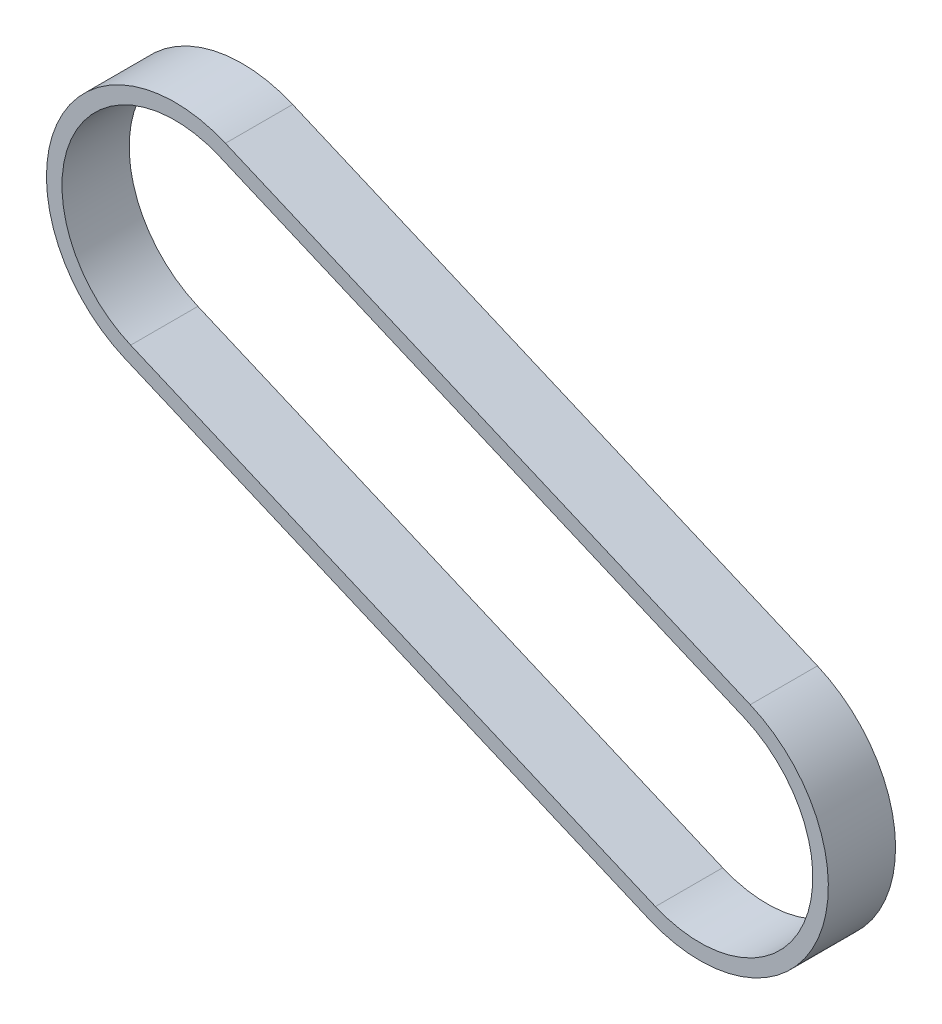
ISO-10303-21;
HEADER;
FILE_DESCRIPTION(('STEP AP214'),'2;1');
FILE_NAME('part.step','',(''),(''),'','','');
FILE_SCHEMA(('AUTOMOTIVE_DESIGN { 1 0 10303 214 1 1 1 1 }'));
ENDSEC;
DATA;
#1=APPLICATION_CONTEXT('core data for automotive mechanical design processes');
#2=APPLICATION_PROTOCOL_DEFINITION('international standard','automotive_design',2000,#1);
#3=PRODUCT_CONTEXT('',#1,'mechanical');
#4=PRODUCT('Part','Part','',(#3));
#5=PRODUCT_RELATED_PRODUCT_CATEGORY('part','',(#4));
#6=PRODUCT_DEFINITION_FORMATION('','',#4);
#7=PRODUCT_DEFINITION_CONTEXT('part definition',#1,'design');
#8=PRODUCT_DEFINITION('design','',#6,#7);
#9=PRODUCT_DEFINITION_SHAPE('','',#8);
#10=(LENGTH_UNIT() NAMED_UNIT(*) SI_UNIT(.MILLI.,.METRE.));
#11=(NAMED_UNIT(*) PLANE_ANGLE_UNIT() SI_UNIT($,.RADIAN.));
#12=(NAMED_UNIT(*) SI_UNIT($,.STERADIAN.) SOLID_ANGLE_UNIT());
#13=UNCERTAINTY_MEASURE_WITH_UNIT(LENGTH_MEASURE(1.E-05),#10,'distance_accuracy_value','');
#14=(GEOMETRIC_REPRESENTATION_CONTEXT(3) GLOBAL_UNCERTAINTY_ASSIGNED_CONTEXT((#13)) GLOBAL_UNIT_ASSIGNED_CONTEXT((#10,
#11,#12)) REPRESENTATION_CONTEXT('',''));
#15=CARTESIAN_POINT('',(0.,0.,0.));
#16=DIRECTION('',(0.,0.,1.));
#17=DIRECTION('',(1.,0.,0.));
#18=AXIS2_PLACEMENT_3D('',#15,#16,#17);
#19=CARTESIAN_POINT('',(-0.322109758430805,0.89426872354878,-161.236191106852));
#20=DIRECTION('',(0.,0.,1.));
#21=DIRECTION('',(1.,0.,0.));
#22=AXIS2_PLACEMENT_3D('',#19,#20,#21);
#23=CYLINDRICAL_SURFACE('',#22,21.04);
#24=DIRECTION('',(0.,0.,1.));
#25=VECTOR('',#24,1.);
#26=CARTESIAN_POINT('',(-8.57598271858708,-18.4591594264613,-161.236191106852));
#27=LINE('',#26,#25);
#28=CARTESIAN_POINT('',(-8.57598271858708,-18.4591594264613,-11.0000000000194));
#29=VERTEX_POINT('',#28);
#30=CARTESIAN_POINT('',(-8.57598271858708,-18.4591594264613,0.));
#31=VERTEX_POINT('',#30);
#32=EDGE_CURVE('E153',#29,#31,#27,.T.);
#33=ORIENTED_EDGE('',*,*,#32,.F.);
#34=CARTESIAN_POINT('',(-0.322109758430805,0.89426872354878,-11.0000000000195));
#35=DIRECTION('',(0.,0.,-1.));
#36=DIRECTION('',(0.,1.,0.));
#37=AXIS2_PLACEMENT_3D('',#34,#35,#36);
#38=CIRCLE('',#37,21.04);
#39=CARTESIAN_POINT('',(7.93176320172548,20.2476968735588,-11.0000000000195));
#40=VERTEX_POINT('',#39);
#41=EDGE_CURVE('E147',#29,#40,#38,.F.);
#42=ORIENTED_EDGE('',*,*,#41,.T.);
#43=DIRECTION('',(0.,0.,1.));
#44=VECTOR('',#43,1.);
#45=CARTESIAN_POINT('',(7.93176320172548,20.2476968735588,-161.236191106852));
#46=LINE('',#45,#44);
#47=CARTESIAN_POINT('',(7.93176320172548,20.2476968735588,0.));
#48=VERTEX_POINT('',#47);
#49=EDGE_CURVE('E149',#40,#48,#46,.T.);
#50=ORIENTED_EDGE('',*,*,#49,.T.);
#51=CARTESIAN_POINT('',(-0.322109758430805,0.89426872354878,0.));
#52=DIRECTION('',(0.,0.,-1.));
#53=DIRECTION('',(-1.,0.,0.));
#54=AXIS2_PLACEMENT_3D('',#51,#52,#53);
#55=CIRCLE('',#54,21.04);
#56=EDGE_CURVE('E175',#31,#48,#55,.F.);
#57=ORIENTED_EDGE('',*,*,#56,.F.);
#58=EDGE_LOOP('',(#33,#42,#50,#57));
#59=FACE_BOUND('',#58,.T.);
#60=ADVANCED_FACE('F59',(#59),#23,.T.);
#61=CARTESIAN_POINT('',(-8.57598271858708,-18.4591594264613,-161.236191106852));
#62=DIRECTION('',(-0.39229434221275,-0.919839740970059,0.));
#63=DIRECTION('',(0.919839740970059,-0.39229434221275,0.));
#64=AXIS2_PLACEMENT_3D('',#61,#62,#63);
#65=PLANE('',#64);
#66=DIRECTION('',(0.,0.,1.));
#67=VECTOR('',#66,1.);
#68=CARTESIAN_POINT('',(-94.4636745780762,18.1703251255509,-161.236191106852));
#69=LINE('',#68,#67);
#70=CARTESIAN_POINT('',(-94.4636745780762,18.1703251255509,-11.0000000000195));
#71=VERTEX_POINT('',#70);
#72=CARTESIAN_POINT('',(-94.4636745780762,18.1703251255509,0.));
#73=VERTEX_POINT('',#72);
#74=EDGE_CURVE('E156',#71,#73,#69,.T.);
#75=ORIENTED_EDGE('',*,*,#74,.F.);
#76=DIRECTION('',(0.919839740970059,-0.39229434221275,0.));
#77=VECTOR('',#76,1.);
#78=CARTESIAN_POINT('',(-8.57598271858715,-18.4591594264612,-11.0000000000194));
#79=LINE('',#78,#77);
#80=EDGE_CURVE('E150',#71,#29,#79,.T.);
#81=ORIENTED_EDGE('',*,*,#80,.T.);
#82=ORIENTED_EDGE('',*,*,#32,.T.);
#83=DIRECTION('',(0.919839740970059,-0.392294342212751,0.));
#84=VECTOR('',#83,1.);
#85=CARTESIAN_POINT('',(-8.57598271858708,-18.4591594264613,0.));
#86=LINE('',#85,#84);
#87=EDGE_CURVE('E142',#73,#31,#86,.T.);
#88=ORIENTED_EDGE('',*,*,#87,.F.);
#89=EDGE_LOOP('',(#75,#81,#82,#88));
#90=FACE_BOUND('',#89,.T.);
#91=ADVANCED_FACE('F195',(#90),#65,.T.);
#92=CARTESIAN_POINT('',(-86.2098016179199,37.523753275561,-161.236191106852));
#93=DIRECTION('',(0.,0.,1.));
#94=DIRECTION('',(1.,0.,0.));
#95=AXIS2_PLACEMENT_3D('',#92,#93,#94);
#96=CYLINDRICAL_SURFACE('',#95,21.04);
#97=DIRECTION('',(0.,0.,1.));
#98=VECTOR('',#97,1.);
#99=CARTESIAN_POINT('',(-77.9559286577636,56.877181425571,-161.236191106852));
#100=LINE('',#99,#98);
#101=CARTESIAN_POINT('',(-77.9559286577636,56.877181425571,-11.0000000000195));
#102=VERTEX_POINT('',#101);
#103=CARTESIAN_POINT('',(-77.9559286577636,56.877181425571,0.));
#104=VERTEX_POINT('',#103);
#105=EDGE_CURVE('E160',#102,#104,#100,.T.);
#106=ORIENTED_EDGE('',*,*,#105,.F.);
#107=CARTESIAN_POINT('',(-86.2098016179199,37.523753275561,-11.0000000000195));
#108=DIRECTION('',(0.,0.,-1.));
#109=DIRECTION('',(0.,1.,0.));
#110=AXIS2_PLACEMENT_3D('',#107,#108,#109);
#111=CIRCLE('',#110,21.04);
#112=EDGE_CURVE('E154',#102,#71,#111,.F.);
#113=ORIENTED_EDGE('',*,*,#112,.T.);
#114=ORIENTED_EDGE('',*,*,#74,.T.);
#115=CARTESIAN_POINT('',(-86.2098016179199,37.523753275561,0.));
#116=DIRECTION('',(0.,0.,-1.));
#117=DIRECTION('',(-1.,0.,0.));
#118=AXIS2_PLACEMENT_3D('',#115,#116,#117);
#119=CIRCLE('',#118,21.04);
#120=EDGE_CURVE('E185',#104,#73,#119,.F.);
#121=ORIENTED_EDGE('',*,*,#120,.F.);
#122=EDGE_LOOP('',(#106,#113,#114,#121));
#123=FACE_BOUND('',#122,.T.);
#124=ADVANCED_FACE('F203',(#123),#96,.T.);
#125=CARTESIAN_POINT('',(7.93176320172546,20.2476968735588,-161.236191106852));
#126=DIRECTION('',(0.39229434221275,0.919839740970059,0.));
#127=DIRECTION('',(-0.919839740970059,0.39229434221275,0.));
#128=AXIS2_PLACEMENT_3D('',#125,#126,#127);
#129=PLANE('',#128);
#130=ORIENTED_EDGE('',*,*,#49,.F.);
#131=DIRECTION('',(-0.919839740970059,0.39229434221275,0.));
#132=VECTOR('',#131,1.);
#133=CARTESIAN_POINT('',(7.93176320172539,20.2476968735588,-11.0000000000195));
#134=LINE('',#133,#132);
#135=EDGE_CURVE('E77',#40,#102,#134,.T.);
#136=ORIENTED_EDGE('',*,*,#135,.T.);
#137=ORIENTED_EDGE('',*,*,#105,.T.);
#138=DIRECTION('',(-0.919839740970059,0.392294342212751,0.));
#139=VECTOR('',#138,1.);
#140=CARTESIAN_POINT('',(7.93176320172546,20.2476968735588,0.));
#141=LINE('',#140,#139);
#142=EDGE_CURVE('E180',#48,#104,#141,.T.);
#143=ORIENTED_EDGE('',*,*,#142,.F.);
#144=EDGE_LOOP('',(#130,#136,#137,#143));
#145=FACE_BOUND('',#144,.T.);
#146=ADVANCED_FACE('F200',(#145),#129,.T.);
#147=CARTESIAN_POINT('',(-0.322109758430805,0.89426872354878,-161.236191106852));
#148=DIRECTION('',(0.,0.,1.));
#149=DIRECTION('',(1.,0.,0.));
#150=AXIS2_PLACEMENT_3D('',#147,#148,#149);
#151=CYLINDRICAL_SURFACE('',#150,18.5);
#152=CARTESIAN_POINT('',(-0.322109758430805,0.89426872354878,-11.0000000000195));
#153=DIRECTION('',(0.,0.,-1.));
#154=DIRECTION('',(0.,1.,0.));
#155=AXIS2_PLACEMENT_3D('',#152,#153,#154);
#156=CIRCLE('',#155,18.5);
#157=CARTESIAN_POINT('',(-7.57955508936669,-16.1227664843973,-11.0000000000195));
#158=VERTEX_POINT('',#157);
#159=CARTESIAN_POINT('',(6.93533557250508,17.9113039314949,-11.0000000000195));
#160=VERTEX_POINT('',#159);
#161=EDGE_CURVE('E123',#158,#160,#156,.F.);
#162=ORIENTED_EDGE('',*,*,#161,.F.);
#163=DIRECTION('',(0.,0.,1.));
#164=VECTOR('',#163,1.);
#165=CARTESIAN_POINT('',(-7.57955508936669,-16.1227664843973,-161.236191106852));
#166=LINE('',#165,#164);
#167=CARTESIAN_POINT('',(-7.57955508936669,-16.1227664843973,0.));
#168=VERTEX_POINT('',#167);
#169=EDGE_CURVE('E162',#158,#168,#166,.T.);
#170=ORIENTED_EDGE('',*,*,#169,.T.);
#171=CARTESIAN_POINT('',(-0.322109758430805,0.89426872354878,0.));
#172=DIRECTION('',(0.,0.,1.));
#173=DIRECTION('',(-1.,0.,0.));
#174=AXIS2_PLACEMENT_3D('',#171,#172,#173);
#175=CIRCLE('',#174,18.5);
#176=CARTESIAN_POINT('',(6.93533557250508,17.9113039314949,0.));
#177=VERTEX_POINT('',#176);
#178=EDGE_CURVE('E126',#168,#177,#175,.T.);
#179=ORIENTED_EDGE('',*,*,#178,.T.);
#180=DIRECTION('',(0.,0.,1.));
#181=VECTOR('',#180,1.);
#182=CARTESIAN_POINT('',(6.93533557250508,17.9113039314949,-161.236191106852));
#183=LINE('',#182,#181);
#184=EDGE_CURVE('E63',#160,#177,#183,.T.);
#185=ORIENTED_EDGE('',*,*,#184,.F.);
#186=EDGE_LOOP('',(#162,#170,#179,#185));
#187=FACE_BOUND('',#186,.T.);
#188=ADVANCED_FACE('F121',(#187),#151,.F.);
#189=CARTESIAN_POINT('',(-7.57955508936669,-16.1227664843973,-161.236191106852));
#190=DIRECTION('',(-0.39229434221275,-0.919839740970059,0.));
#191=DIRECTION('',(0.919839740970059,-0.392294342212751,0.));
#192=AXIS2_PLACEMENT_3D('',#189,#190,#191);
#193=PLANE('',#192);
#194=DIRECTION('',(0.919839740970059,-0.39229434221275,0.));
#195=VECTOR('',#194,1.);
#196=CARTESIAN_POINT('',(-7.57955508936676,-16.1227664843973,-11.0000000000194));
#197=LINE('',#196,#195);
#198=CARTESIAN_POINT('',(-93.4672469488558,20.5067180676149,-11.0000000000196));
#199=VERTEX_POINT('',#198);
#200=EDGE_CURVE('E140',#199,#158,#197,.T.);
#201=ORIENTED_EDGE('',*,*,#200,.F.);
#202=DIRECTION('',(0.,0.,1.));
#203=VECTOR('',#202,1.);
#204=CARTESIAN_POINT('',(-93.4672469488558,20.5067180676149,-161.236191106852));
#205=LINE('',#204,#203);
#206=CARTESIAN_POINT('',(-93.4672469488558,20.5067180676149,0.));
#207=VERTEX_POINT('',#206);
#208=EDGE_CURVE('E165',#199,#207,#205,.T.);
#209=ORIENTED_EDGE('',*,*,#208,.T.);
#210=DIRECTION('',(0.919839740970059,-0.39229434221275,0.));
#211=VECTOR('',#210,1.);
#212=CARTESIAN_POINT('',(-7.57955508936669,-16.1227664843973,0.));
#213=LINE('',#212,#211);
#214=EDGE_CURVE('E166',#207,#168,#213,.T.);
#215=ORIENTED_EDGE('',*,*,#214,.T.);
#216=ORIENTED_EDGE('',*,*,#169,.F.);
#217=EDGE_LOOP('',(#201,#209,#215,#216));
#218=FACE_BOUND('',#217,.T.);
#219=ADVANCED_FACE('F223',(#218),#193,.F.);
#220=CARTESIAN_POINT('',(-86.2098016179199,37.523753275561,-161.236191106852));
#221=DIRECTION('',(0.,0.,1.));
#222=DIRECTION('',(1.,0.,0.));
#223=AXIS2_PLACEMENT_3D('',#220,#221,#222);
#224=CYLINDRICAL_SURFACE('',#223,18.5);
#225=CARTESIAN_POINT('',(-86.2098016179199,37.523753275561,-11.0000000000195));
#226=DIRECTION('',(0.,0.,-1.));
#227=DIRECTION('',(0.,1.,0.));
#228=AXIS2_PLACEMENT_3D('',#225,#226,#227);
#229=CIRCLE('',#228,18.5);
#230=CARTESIAN_POINT('',(-78.952356286984,54.5407884835071,-11.0000000000196));
#231=VERTEX_POINT('',#230);
#232=EDGE_CURVE('E12',#231,#199,#229,.F.);
#233=ORIENTED_EDGE('',*,*,#232,.F.);
#234=DIRECTION('',(0.,0.,1.));
#235=VECTOR('',#234,1.);
#236=CARTESIAN_POINT('',(-78.952356286984,54.5407884835071,-161.236191106852));
#237=LINE('',#236,#235);
#238=CARTESIAN_POINT('',(-78.952356286984,54.5407884835071,0.));
#239=VERTEX_POINT('',#238);
#240=EDGE_CURVE('E135',#231,#239,#237,.T.);
#241=ORIENTED_EDGE('',*,*,#240,.T.);
#242=CARTESIAN_POINT('',(-86.2098016179199,37.523753275561,0.));
#243=DIRECTION('',(0.,0.,1.));
#244=DIRECTION('',(-1.,0.,0.));
#245=AXIS2_PLACEMENT_3D('',#242,#243,#244);
#246=CIRCLE('',#245,18.5);
#247=EDGE_CURVE('E131',#239,#207,#246,.T.);
#248=ORIENTED_EDGE('',*,*,#247,.T.);
#249=ORIENTED_EDGE('',*,*,#208,.F.);
#250=EDGE_LOOP('',(#233,#241,#248,#249));
#251=FACE_BOUND('',#250,.T.);
#252=ADVANCED_FACE('F220',(#251),#224,.F.);
#253=CARTESIAN_POINT('',(-78.952356286984,54.5407884835071,-161.236191106852));
#254=DIRECTION('',(0.39229434221275,0.919839740970059,0.));
#255=DIRECTION('',(-0.919839740970059,0.392294342212751,0.));
#256=AXIS2_PLACEMENT_3D('',#253,#254,#255);
#257=PLANE('',#256);
#258=DIRECTION('',(-0.919839740970059,0.39229434221275,0.));
#259=VECTOR('',#258,1.);
#260=CARTESIAN_POINT('',(-78.9523562869841,54.5407884835071,-11.0000000000196));
#261=LINE('',#260,#259);
#262=EDGE_CURVE('E69',#160,#231,#261,.T.);
#263=ORIENTED_EDGE('',*,*,#262,.F.);
#264=ORIENTED_EDGE('',*,*,#184,.T.);
#265=DIRECTION('',(-0.919839740970059,0.39229434221275,0.));
#266=VECTOR('',#265,1.);
#267=CARTESIAN_POINT('',(-78.952356286984,54.5407884835071,0.));
#268=LINE('',#267,#266);
#269=EDGE_CURVE('E130',#177,#239,#268,.T.);
#270=ORIENTED_EDGE('',*,*,#269,.T.);
#271=ORIENTED_EDGE('',*,*,#240,.F.);
#272=EDGE_LOOP('',(#263,#264,#270,#271));
#273=FACE_BOUND('',#272,.T.);
#274=ADVANCED_FACE('F134',(#273),#257,.F.);
#275=CARTESIAN_POINT('',(-0.322109758430805,0.89426872354878,0.));
#276=DIRECTION('',(0.,0.,-1.));
#277=DIRECTION('',(-1.,0.,0.));
#278=AXIS2_PLACEMENT_3D('',#275,#276,#277);
#279=PLANE('',#278);
#280=ORIENTED_EDGE('',*,*,#269,.F.);
#281=ORIENTED_EDGE('',*,*,#178,.F.);
#282=ORIENTED_EDGE('',*,*,#214,.F.);
#283=ORIENTED_EDGE('',*,*,#247,.F.);
#284=EDGE_LOOP('',(#280,#281,#282,#283));
#285=FACE_BOUND('',#284,.T.);
#286=ORIENTED_EDGE('',*,*,#56,.T.);
#287=ORIENTED_EDGE('',*,*,#142,.T.);
#288=ORIENTED_EDGE('',*,*,#120,.T.);
#289=ORIENTED_EDGE('',*,*,#87,.T.);
#290=EDGE_LOOP('',(#286,#287,#288,#289));
#291=FACE_BOUND('',#290,.T.);
#292=ADVANCED_FACE('F191',(#285,#291),#279,.F.);
#293=CARTESIAN_POINT('',(-0.322109758430861,0.894268723548744,-11.0000000000195));
#294=DIRECTION('',(0.,0.,-1.));
#295=DIRECTION('',(0.927061259829081,0.374909883204106,0.));
#296=AXIS2_PLACEMENT_3D('',#293,#294,#295);
#297=PLANE('',#296);
#298=ORIENTED_EDGE('',*,*,#41,.F.);
#299=ORIENTED_EDGE('',*,*,#80,.F.);
#300=ORIENTED_EDGE('',*,*,#112,.F.);
#301=ORIENTED_EDGE('',*,*,#135,.F.);
#302=EDGE_LOOP('',(#298,#299,#300,#301));
#303=FACE_BOUND('',#302,.T.);
#304=ORIENTED_EDGE('',*,*,#200,.T.);
#305=ORIENTED_EDGE('',*,*,#161,.T.);
#306=ORIENTED_EDGE('',*,*,#262,.T.);
#307=ORIENTED_EDGE('',*,*,#232,.T.);
#308=EDGE_LOOP('',(#304,#305,#306,#307));
#309=FACE_BOUND('',#308,.T.);
#310=ADVANCED_FACE('F61',(#303,#309),#297,.T.);
#311=CLOSED_SHELL('',(#60,#91,#124,#146,#188,#219,#252,#274,#292,#310));
#312=MANIFOLD_SOLID_BREP('B2',#311);
#313=ADVANCED_BREP_SHAPE_REPRESENTATION('',(#18,#312),#14);
#314=SHAPE_DEFINITION_REPRESENTATION(#9,#313);
ENDSEC;
END-ISO-10303-21;
